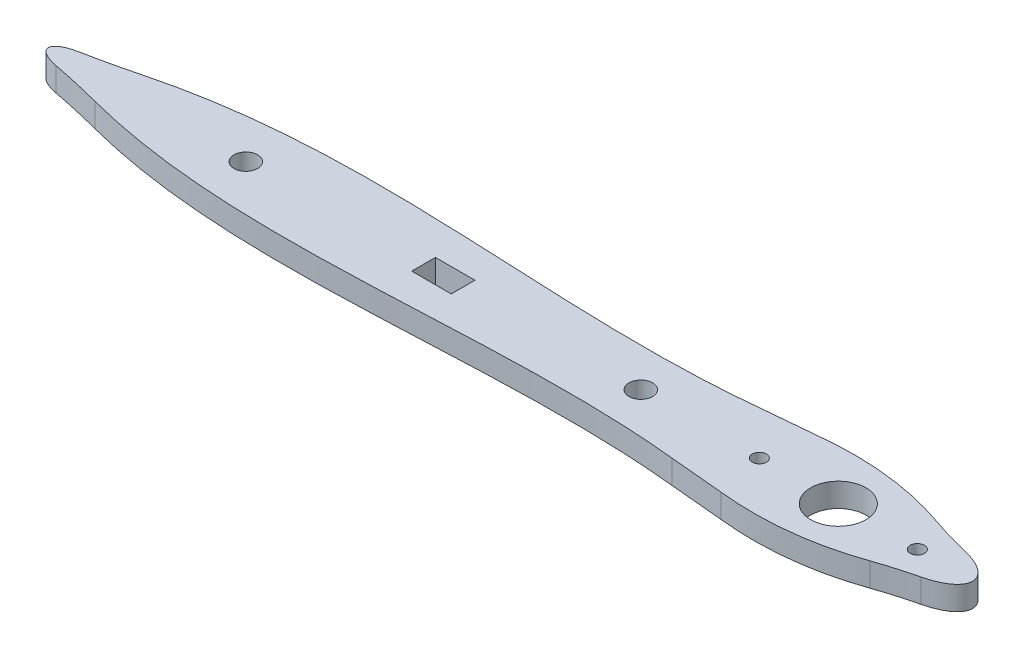
ISO-10303-21;
HEADER;
FILE_DESCRIPTION(('STEP AP214'),'2;1');
FILE_NAME('part.step','',(''),(''),'','','');
FILE_SCHEMA(('AUTOMOTIVE_DESIGN { 1 0 10303 214 1 1 1 1 }'));
ENDSEC;
DATA;
#1=APPLICATION_CONTEXT('core data for automotive mechanical design processes');
#2=APPLICATION_PROTOCOL_DEFINITION('international standard','automotive_design',2000,#1);
#3=PRODUCT_CONTEXT('',#1,'mechanical');
#4=PRODUCT('Part','Part','',(#3));
#5=PRODUCT_RELATED_PRODUCT_CATEGORY('part','',(#4));
#6=PRODUCT_DEFINITION_FORMATION('','',#4);
#7=PRODUCT_DEFINITION_CONTEXT('part definition',#1,'design');
#8=PRODUCT_DEFINITION('design','',#6,#7);
#9=PRODUCT_DEFINITION_SHAPE('','',#8);
#10=(LENGTH_UNIT() NAMED_UNIT(*) SI_UNIT(.MILLI.,.METRE.));
#11=(NAMED_UNIT(*) PLANE_ANGLE_UNIT() SI_UNIT($,.RADIAN.));
#12=(NAMED_UNIT(*) SI_UNIT($,.STERADIAN.) SOLID_ANGLE_UNIT());
#13=UNCERTAINTY_MEASURE_WITH_UNIT(LENGTH_MEASURE(1.E-05),#10,'distance_accuracy_value','');
#14=(GEOMETRIC_REPRESENTATION_CONTEXT(3) GLOBAL_UNCERTAINTY_ASSIGNED_CONTEXT((#13)) GLOBAL_UNIT_ASSIGNED_CONTEXT((#10,
#11,#12)) REPRESENTATION_CONTEXT('',''));
#15=CARTESIAN_POINT('',(0.,0.,0.));
#16=DIRECTION('',(0.,0.,1.));
#17=DIRECTION('',(1.,0.,0.));
#18=AXIS2_PLACEMENT_3D('',#15,#16,#17);
#19=CARTESIAN_POINT('',(-47.5,3.,0.));
#20=DIRECTION('',(-1.,0.,0.));
#21=DIRECTION('',(0.,0.,1.));
#22=AXIS2_PLACEMENT_3D('',#19,#20,#21);
#23=PLANE('',#22);
#24=DIRECTION('',(0.,0.,-1.));
#25=VECTOR('',#24,1.);
#26=CARTESIAN_POINT('',(-47.5,0.,0.));
#27=LINE('',#26,#25);
#28=CARTESIAN_POINT('',(-47.5,0.,1.50000000000001));
#29=VERTEX_POINT('',#28);
#30=CARTESIAN_POINT('',(-47.5,0.,-1.50000000000008));
#31=VERTEX_POINT('',#30);
#32=EDGE_CURVE('E277',#29,#31,#27,.T.);
#33=ORIENTED_EDGE('',*,*,#32,.F.);
#34=DIRECTION('',(0.,-1.,0.));
#35=VECTOR('',#34,1.);
#36=CARTESIAN_POINT('',(-47.5,3.,1.50000000000001));
#37=LINE('',#36,#35);
#38=CARTESIAN_POINT('',(-47.5,3.,1.50000000000001));
#39=VERTEX_POINT('',#38);
#40=EDGE_CURVE('E11',#39,#29,#37,.T.);
#41=ORIENTED_EDGE('',*,*,#40,.F.);
#42=DIRECTION('',(0.,0.,-1.));
#43=VECTOR('',#42,1.);
#44=CARTESIAN_POINT('',(-47.5,3.,0.));
#45=LINE('',#44,#43);
#46=CARTESIAN_POINT('',(-47.5,3.,-1.50000000000008));
#47=VERTEX_POINT('',#46);
#48=EDGE_CURVE('E181',#39,#47,#45,.T.);
#49=ORIENTED_EDGE('',*,*,#48,.T.);
#50=DIRECTION('',(0.,-1.,0.));
#51=VECTOR('',#50,1.);
#52=CARTESIAN_POINT('',(-47.5,3.,-1.50000000000008));
#53=LINE('',#52,#51);
#54=EDGE_CURVE('E62',#47,#31,#53,.T.);
#55=ORIENTED_EDGE('',*,*,#54,.T.);
#56=EDGE_LOOP('',(#33,#41,#49,#55));
#57=FACE_BOUND('',#56,.T.);
#58=ADVANCED_FACE('F41',(#57),#23,.T.);
#59=CARTESIAN_POINT('',(0.,3.,1.50000000000001));
#60=DIRECTION('',(0.,0.,-1.));
#61=DIRECTION('',(-1.,0.,0.));
#62=AXIS2_PLACEMENT_3D('',#59,#60,#61);
#63=PLANE('',#62);
#64=DIRECTION('',(1.,0.,0.));
#65=VECTOR('',#64,1.);
#66=CARTESIAN_POINT('',(0.,0.,1.50000000000001));
#67=LINE('',#66,#65);
#68=CARTESIAN_POINT('',(-52.5,0.,1.50000000000001));
#69=VERTEX_POINT('',#68);
#70=EDGE_CURVE('E168',#69,#29,#67,.T.);
#71=ORIENTED_EDGE('',*,*,#70,.F.);
#72=DIRECTION('',(0.,-1.,0.));
#73=VECTOR('',#72,1.);
#74=CARTESIAN_POINT('',(-52.5,3.,1.50000000000001));
#75=LINE('',#74,#73);
#76=CARTESIAN_POINT('',(-52.5,3.,1.50000000000001));
#77=VERTEX_POINT('',#76);
#78=EDGE_CURVE('E53',#77,#69,#75,.T.);
#79=ORIENTED_EDGE('',*,*,#78,.F.);
#80=DIRECTION('',(1.,0.,0.));
#81=VECTOR('',#80,1.);
#82=CARTESIAN_POINT('',(0.,3.,1.50000000000001));
#83=LINE('',#82,#81);
#84=EDGE_CURVE('E166',#77,#39,#83,.T.);
#85=ORIENTED_EDGE('',*,*,#84,.T.);
#86=ORIENTED_EDGE('',*,*,#40,.T.);
#87=EDGE_LOOP('',(#71,#79,#85,#86));
#88=FACE_BOUND('',#87,.T.);
#89=ADVANCED_FACE('F165',(#88),#63,.T.);
#90=CARTESIAN_POINT('',(-52.5,3.,0.));
#91=DIRECTION('',(1.,0.,0.));
#92=DIRECTION('',(0.,0.,-1.));
#93=AXIS2_PLACEMENT_3D('',#90,#91,#92);
#94=PLANE('',#93);
#95=DIRECTION('',(0.,0.,1.));
#96=VECTOR('',#95,1.);
#97=CARTESIAN_POINT('',(-52.5,0.,0.));
#98=LINE('',#97,#96);
#99=CARTESIAN_POINT('',(-52.5,0.,-1.50000000000008));
#100=VERTEX_POINT('',#99);
#101=EDGE_CURVE('E282',#100,#69,#98,.T.);
#102=ORIENTED_EDGE('',*,*,#101,.F.);
#103=DIRECTION('',(0.,-1.,0.));
#104=VECTOR('',#103,1.);
#105=CARTESIAN_POINT('',(-52.5,3.,-1.50000000000008));
#106=LINE('',#105,#104);
#107=CARTESIAN_POINT('',(-52.5,3.,-1.50000000000008));
#108=VERTEX_POINT('',#107);
#109=EDGE_CURVE('E111',#108,#100,#106,.T.);
#110=ORIENTED_EDGE('',*,*,#109,.F.);
#111=DIRECTION('',(0.,0.,1.));
#112=VECTOR('',#111,1.);
#113=CARTESIAN_POINT('',(-52.5,3.,0.));
#114=LINE('',#113,#112);
#115=EDGE_CURVE('E180',#108,#77,#114,.T.);
#116=ORIENTED_EDGE('',*,*,#115,.T.);
#117=ORIENTED_EDGE('',*,*,#78,.T.);
#118=EDGE_LOOP('',(#102,#110,#116,#117));
#119=FACE_BOUND('',#118,.T.);
#120=ADVANCED_FACE('F184',(#119),#94,.T.);
#121=CARTESIAN_POINT('',(-95.4266181455895,3.,0.));
#122=DIRECTION('',(0.,1.,0.));
#123=DIRECTION('',(-1.,0.,0.));
#124=AXIS2_PLACEMENT_3D('',#121,#122,#123);
#125=ELLIPSE('',#124,4.5733818544105,1.67774940956735);
#126=DIRECTION('',(0.,-1.,0.));
#127=VECTOR('',#126,1.);
#128=SURFACE_OF_LINEAR_EXTRUSION('',#125,#127);
#129=CARTESIAN_POINT('',(-95.4266181455895,0.,0.));
#130=DIRECTION('',(0.,1.,0.));
#131=DIRECTION('',(-1.,0.,0.));
#132=AXIS2_PLACEMENT_3D('',#129,#130,#131);
#133=ELLIPSE('',#132,4.5733818544105,1.67774940956735);
#134=CARTESIAN_POINT('',(-97.5494712931568,0.,-1.48605495763457));
#135=VERTEX_POINT('',#134);
#136=CARTESIAN_POINT('',(-97.5494712931573,0.,1.4860549576345));
#137=VERTEX_POINT('',#136);
#138=EDGE_CURVE('E209',#135,#137,#133,.T.);
#139=ORIENTED_EDGE('',*,*,#138,.T.);
#140=DIRECTION('',(0.,-1.,0.));
#141=VECTOR('',#140,1.);
#142=CARTESIAN_POINT('',(-97.5494712931573,3.,1.4860549576345));
#143=LINE('',#142,#141);
#144=CARTESIAN_POINT('',(-97.5494712931573,3.,1.4860549576345));
#145=VERTEX_POINT('',#144);
#146=EDGE_CURVE('E46',#145,#137,#143,.T.);
#147=ORIENTED_EDGE('',*,*,#146,.F.);
#148=CARTESIAN_POINT('',(-97.5494712931568,3.,-1.48605495763457));
#149=VERTEX_POINT('',#148);
#150=EDGE_CURVE('E305',#149,#145,#125,.T.);
#151=ORIENTED_EDGE('',*,*,#150,.F.);
#152=DIRECTION('',(0.,-1.,0.));
#153=VECTOR('',#152,1.);
#154=CARTESIAN_POINT('',(-97.5494712931568,3.,-1.48605495763457));
#155=LINE('',#154,#153);
#156=EDGE_CURVE('E208',#149,#135,#155,.T.);
#157=ORIENTED_EDGE('',*,*,#156,.T.);
#158=EDGE_LOOP('',(#139,#147,#151,#157));
#159=FACE_BOUND('',#158,.T.);
#160=ADVANCED_FACE('F43',(#159),#128,.F.);
#161=CARTESIAN_POINT('',(-116.428663075595,3.,99.6877663360108));
#162=DIRECTION('',(0.,-1.,0.));
#163=DIRECTION('',(0.,0.,-1.));
#164=AXIS2_PLACEMENT_3D('',#161,#162,#163);
#165=CYLINDRICAL_SURFACE('',#164,100.);
#166=CARTESIAN_POINT('',(-116.428663075595,0.,99.6877663360108));
#167=DIRECTION('',(0.,1.,0.));
#168=DIRECTION('',(0.,0.,1.));
#169=AXIS2_PLACEMENT_3D('',#166,#167,#168);
#170=CIRCLE('',#169,100.);
#171=CARTESIAN_POINT('',(-91.1354786617065,0.,2.9393564152012));
#172=VERTEX_POINT('',#171);
#173=EDGE_CURVE('E213',#137,#172,#170,.F.);
#174=ORIENTED_EDGE('',*,*,#173,.T.);
#175=DIRECTION('',(0.,-1.,0.));
#176=VECTOR('',#175,1.);
#177=CARTESIAN_POINT('',(-91.1354786617065,3.,2.9393564152012));
#178=LINE('',#177,#176);
#179=CARTESIAN_POINT('',(-91.1354786617065,3.,2.9393564152012));
#180=VERTEX_POINT('',#179);
#181=EDGE_CURVE('E341',#180,#172,#178,.T.);
#182=ORIENTED_EDGE('',*,*,#181,.F.);
#183=CARTESIAN_POINT('',(-116.428663075595,3.,99.6877663360108));
#184=DIRECTION('',(0.,1.,0.));
#185=DIRECTION('',(0.,0.,1.));
#186=AXIS2_PLACEMENT_3D('',#183,#184,#185);
#187=CIRCLE('',#186,100.);
#188=EDGE_CURVE('E124',#145,#180,#187,.F.);
#189=ORIENTED_EDGE('',*,*,#188,.F.);
#190=ORIENTED_EDGE('',*,*,#146,.T.);
#191=EDGE_LOOP('',(#174,#182,#189,#190));
#192=FACE_BOUND('',#191,.T.);
#193=ADVANCED_FACE('F349',(#192),#165,.F.);
#194=CARTESIAN_POINT('',(-91.1354786617065,3.,2.93935641520122));
#195=CARTESIAN_POINT('',(-85.8147090714319,3.,4.33037882663711));
#196=CARTESIAN_POINT('',(-60.9175612268035,3.,7.97508815959745));
#197=CARTESIAN_POINT('',(-35.1324327132966,3.,3.48955228013661));
#198=CARTESIAN_POINT('',(-15.53242609968,3.,5.5269007593906));
#199=B_SPLINE_CURVE_WITH_KNOTS('',3,(#194,#195,#196,#197,#198),.UNSPECIFIED.,.F.,.F.,(4,1,4),
(0.107974897642226,0.300967180896954,1.),.UNSPECIFIED.);
#200=DIRECTION('',(0.,-1.,0.));
#201=VECTOR('',#200,1.);
#202=SURFACE_OF_LINEAR_EXTRUSION('',#199,#201);
#203=CARTESIAN_POINT('',(-91.1354786617065,0.,2.93935641520122));
#204=CARTESIAN_POINT('',(-85.8147090714319,0.,4.33037882663711));
#205=CARTESIAN_POINT('',(-60.9175612268035,0.,7.97508815959745));
#206=CARTESIAN_POINT('',(-35.1324327132966,0.,3.48955228013661));
#207=CARTESIAN_POINT('',(-15.53242609968,0.,5.5269007593906));
#208=B_SPLINE_CURVE_WITH_KNOTS('',3,(#203,#204,#205,#206,#207),.UNSPECIFIED.,.F.,.F.,(4,1,4),
(0.107974897642226,0.300967180896954,1.),.UNSPECIFIED.);
#209=CARTESIAN_POINT('',(-15.53242609968,0.,5.5269007593906));
#210=VERTEX_POINT('',#209);
#211=EDGE_CURVE('E216',#172,#210,#208,.T.);
#212=ORIENTED_EDGE('',*,*,#211,.T.);
#213=DIRECTION('',(0.,-1.,0.));
#214=VECTOR('',#213,1.);
#215=CARTESIAN_POINT('',(-15.53242609968,3.,5.5269007593906));
#216=LINE('',#215,#214);
#217=CARTESIAN_POINT('',(-15.53242609968,3.,5.5269007593906));
#218=VERTEX_POINT('',#217);
#219=EDGE_CURVE('E339',#218,#210,#216,.T.);
#220=ORIENTED_EDGE('',*,*,#219,.F.);
#221=EDGE_CURVE('E627',#180,#218,#199,.T.);
#222=ORIENTED_EDGE('',*,*,#221,.F.);
#223=ORIENTED_EDGE('',*,*,#181,.T.);
#224=EDGE_LOOP('',(#212,#220,#222,#223));
#225=FACE_BOUND('',#224,.T.);
#226=ADVANCED_FACE('F410',(#225),#202,.F.);
#227=CARTESIAN_POINT('',(-0.628159630564506,3.,6.88642461198352));
#228=DIRECTION('',(-0.0908399557754633,0.,0.995865504189553));
#229=DIRECTION('',(0.995865504189553,0.,0.0908399557754633));
#230=AXIS2_PLACEMENT_3D('',#227,#228,#229);
#231=PLANE('',#230);
#232=DIRECTION('',(-0.995865504189553,0.,-0.0908399557754633));
#233=VECTOR('',#232,1.);
#234=CARTESIAN_POINT('',(-0.628159630564506,0.,6.88642461198352));
#235=LINE('',#234,#233);
#236=CARTESIAN_POINT('',(-8.7014778224339,0.,6.14999999999991));
#237=VERTEX_POINT('',#236);
#238=EDGE_CURVE('E222',#237,#210,#235,.T.);
#239=ORIENTED_EDGE('',*,*,#238,.F.);
#240=DIRECTION('',(0.,-1.,0.));
#241=VECTOR('',#240,1.);
#242=CARTESIAN_POINT('',(-8.7014778224339,3.,6.14999999999991));
#243=LINE('',#242,#241);
#244=CARTESIAN_POINT('',(-8.7014778224339,3.,6.14999999999991));
#245=VERTEX_POINT('',#244);
#246=EDGE_CURVE('E336',#245,#237,#243,.T.);
#247=ORIENTED_EDGE('',*,*,#246,.F.);
#248=DIRECTION('',(-0.995865504189553,0.,-0.0908399557754633));
#249=VECTOR('',#248,1.);
#250=CARTESIAN_POINT('',(-0.628159630564506,3.,6.88642461198352));
#251=LINE('',#250,#249);
#252=EDGE_CURVE('E409',#245,#218,#251,.T.);
#253=ORIENTED_EDGE('',*,*,#252,.T.);
#254=ORIENTED_EDGE('',*,*,#219,.T.);
#255=EDGE_LOOP('',(#239,#247,#253,#254));
#256=FACE_BOUND('',#255,.T.);
#257=ADVANCED_FACE('F405',(#256),#231,.T.);
#258=CARTESIAN_POINT('',(8.2697237420884,3.,4.25946897668879));
#259=CARTESIAN_POINT('',(2.8349132427452,3.,6.15734876027866));
#260=CARTESIAN_POINT('',(-2.82215392505476,3.,6.78752581668376));
#261=CARTESIAN_POINT('',(-8.7014778224339,3.,6.14999999999991));
#262=B_SPLINE_CURVE_WITH_KNOTS('',3,(#258,#259,#260,#261),.UNSPECIFIED.,.F.,.F.,(4,4),
(0.353889440275628,1.),.UNSPECIFIED.);
#263=DIRECTION('',(0.,-1.,0.));
#264=VECTOR('',#263,1.);
#265=SURFACE_OF_LINEAR_EXTRUSION('',#262,#264);
#266=CARTESIAN_POINT('',(8.2697237420884,0.,4.25946897668879));
#267=CARTESIAN_POINT('',(2.8349132427452,0.,6.15734876027866));
#268=CARTESIAN_POINT('',(-2.82215392505476,0.,6.78752581668376));
#269=CARTESIAN_POINT('',(-8.7014778224339,0.,6.14999999999991));
#270=B_SPLINE_CURVE_WITH_KNOTS('',3,(#266,#267,#268,#269),.UNSPECIFIED.,.F.,.F.,(4,4),
(0.353889440275628,1.),.UNSPECIFIED.);
#271=CARTESIAN_POINT('',(8.2697237420884,0.,4.25946897668879));
#272=VERTEX_POINT('',#271);
#273=EDGE_CURVE('E229',#272,#237,#270,.T.);
#274=ORIENTED_EDGE('',*,*,#273,.F.);
#275=DIRECTION('',(0.,-1.,0.));
#276=VECTOR('',#275,1.);
#277=CARTESIAN_POINT('',(8.2697237420884,3.,4.25946897668879));
#278=LINE('',#277,#276);
#279=CARTESIAN_POINT('',(8.2697237420884,3.,4.25946897668879));
#280=VERTEX_POINT('',#279);
#281=EDGE_CURVE('E333',#280,#272,#278,.T.);
#282=ORIENTED_EDGE('',*,*,#281,.F.);
#283=EDGE_CURVE('E402',#280,#245,#262,.T.);
#284=ORIENTED_EDGE('',*,*,#283,.T.);
#285=ORIENTED_EDGE('',*,*,#246,.T.);
#286=EDGE_LOOP('',(#274,#282,#284,#285));
#287=FACE_BOUND('',#286,.T.);
#288=ADVANCED_FACE('F401',(#287),#265,.T.);
#289=CARTESIAN_POINT('',(24.753938545321,3.,51.4640308570935));
#290=DIRECTION('',(0.,-1.,0.));
#291=DIRECTION('',(0.,0.,-1.));
#292=AXIS2_PLACEMENT_3D('',#289,#290,#291);
#293=CYLINDRICAL_SURFACE('',#292,50.0000000000007);
#294=CARTESIAN_POINT('',(24.753938545321,0.,51.4640308570935));
#295=DIRECTION('',(0.,1.,0.));
#296=DIRECTION('',(0.,0.,1.));
#297=AXIS2_PLACEMENT_3D('',#294,#295,#296);
#298=CIRCLE('',#297,50.0000000000007);
#299=CARTESIAN_POINT('',(13.2431532591674,0.,2.80704963038625));
#300=VERTEX_POINT('',#299);
#301=EDGE_CURVE('E235',#272,#300,#298,.F.);
#302=ORIENTED_EDGE('',*,*,#301,.T.);
#303=DIRECTION('',(0.,-1.,0.));
#304=VECTOR('',#303,1.);
#305=CARTESIAN_POINT('',(13.2431532591674,3.,2.80704963038625));
#306=LINE('',#305,#304);
#307=CARTESIAN_POINT('',(13.2431532591674,3.,2.80704963038625));
#308=VERTEX_POINT('',#307);
#309=EDGE_CURVE('E329',#308,#300,#306,.T.);
#310=ORIENTED_EDGE('',*,*,#309,.F.);
#311=CARTESIAN_POINT('',(24.753938545321,3.,51.4640308570935));
#312=DIRECTION('',(0.,1.,0.));
#313=DIRECTION('',(0.,0.,1.));
#314=AXIS2_PLACEMENT_3D('',#311,#312,#313);
#315=CIRCLE('',#314,50.0000000000007);
#316=EDGE_CURVE('E397',#280,#308,#315,.F.);
#317=ORIENTED_EDGE('',*,*,#316,.F.);
#318=ORIENTED_EDGE('',*,*,#281,.T.);
#319=EDGE_LOOP('',(#302,#310,#317,#318));
#320=FACE_BOUND('',#319,.T.);
#321=ADVANCED_FACE('F396',(#320),#293,.F.);
#322=CARTESIAN_POINT('',(10.0000045781328,3.,-7.43034571371037E-07));
#323=DIRECTION('',(0.,1.,0.));
#324=DIRECTION('',(1.,0.,0.));
#325=AXIS2_PLACEMENT_3D('',#322,#323,#324);
#326=ELLIPSE('',#325,6.99999866487509,3.16752117407591);
#327=DIRECTION('',(0.,-1.,0.));
#328=VECTOR('',#327,1.);
#329=SURFACE_OF_LINEAR_EXTRUSION('',#326,#328);
#330=CARTESIAN_POINT('',(10.0000045781328,0.,-7.43034571371037E-07));
#331=DIRECTION('',(0.,1.,0.));
#332=DIRECTION('',(1.,0.,0.));
#333=AXIS2_PLACEMENT_3D('',#330,#331,#332);
#334=ELLIPSE('',#333,6.99999866487509,3.16752117407591);
#335=CARTESIAN_POINT('',(13.2431507603538,0.,-2.80705170759964));
#336=VERTEX_POINT('',#335);
#337=EDGE_CURVE('E241',#300,#336,#334,.T.);
#338=ORIENTED_EDGE('',*,*,#337,.T.);
#339=DIRECTION('',(0.,-1.,0.));
#340=VECTOR('',#339,1.);
#341=CARTESIAN_POINT('',(13.2431507603538,3.,-2.80705170759964));
#342=LINE('',#341,#340);
#343=CARTESIAN_POINT('',(13.2431507603538,3.,-2.80705170759964));
#344=VERTEX_POINT('',#343);
#345=EDGE_CURVE('E325',#344,#336,#342,.T.);
#346=ORIENTED_EDGE('',*,*,#345,.F.);
#347=EDGE_CURVE('E393',#308,#344,#326,.T.);
#348=ORIENTED_EDGE('',*,*,#347,.F.);
#349=ORIENTED_EDGE('',*,*,#309,.T.);
#350=EDGE_LOOP('',(#338,#346,#348,#349));
#351=FACE_BOUND('',#350,.T.);
#352=ADVANCED_FACE('F390',(#351),#329,.F.);
#353=CARTESIAN_POINT('',(24.7539253519989,3.,-51.4640354643056));
#354=DIRECTION('',(0.,-1.,0.));
#355=DIRECTION('',(0.,0.,-1.));
#356=AXIS2_PLACEMENT_3D('',#353,#354,#355);
#357=CYLINDRICAL_SURFACE('',#356,50.0000000000001);
#358=CARTESIAN_POINT('',(24.7539253519989,0.,-51.4640354643056));
#359=DIRECTION('',(0.,1.,0.));
#360=DIRECTION('',(0.,0.,1.));
#361=AXIS2_PLACEMENT_3D('',#358,#359,#360);
#362=CIRCLE('',#361,50.0000000000001);
#363=CARTESIAN_POINT('',(8.26972374208836,0.,-4.25946897668882));
#364=VERTEX_POINT('',#363);
#365=EDGE_CURVE('E244',#336,#364,#362,.F.);
#366=ORIENTED_EDGE('',*,*,#365,.T.);
#367=DIRECTION('',(0.,-1.,0.));
#368=VECTOR('',#367,1.);
#369=CARTESIAN_POINT('',(8.26972374208836,3.,-4.25946897668882));
#370=LINE('',#369,#368);
#371=CARTESIAN_POINT('',(8.26972374208836,3.,-4.25946897668882));
#372=VERTEX_POINT('',#371);
#373=EDGE_CURVE('E321',#372,#364,#370,.T.);
#374=ORIENTED_EDGE('',*,*,#373,.F.);
#375=CARTESIAN_POINT('',(24.7539253519989,3.,-51.4640354643056));
#376=DIRECTION('',(0.,1.,0.));
#377=DIRECTION('',(0.,0.,1.));
#378=AXIS2_PLACEMENT_3D('',#375,#376,#377);
#379=CIRCLE('',#378,50.0000000000001);
#380=EDGE_CURVE('E384',#344,#372,#379,.F.);
#381=ORIENTED_EDGE('',*,*,#380,.F.);
#382=ORIENTED_EDGE('',*,*,#345,.T.);
#383=EDGE_LOOP('',(#366,#374,#381,#382));
#384=FACE_BOUND('',#383,.T.);
#385=ADVANCED_FACE('F383',(#384),#357,.F.);
#386=CARTESIAN_POINT('',(8.26972374208834,3.,-4.25946897668882));
#387=CARTESIAN_POINT('',(2.83491271348361,3.,-6.15734724087725));
#388=CARTESIAN_POINT('',(-2.82215338962121,3.,-6.7875273538036));
#389=CARTESIAN_POINT('',(-8.7014778224339,3.,-6.14999999999991));
#390=B_SPLINE_CURVE_WITH_KNOTS('',3,(#386,#387,#388,#389),.UNSPECIFIED.,.F.,.F.,(4,4),
(0.353889440275629,1.),.UNSPECIFIED.);
#391=DIRECTION('',(0.,-1.,0.));
#392=VECTOR('',#391,1.);
#393=SURFACE_OF_LINEAR_EXTRUSION('',#390,#392);
#394=CARTESIAN_POINT('',(8.26972374208834,0.,-4.25946897668882));
#395=CARTESIAN_POINT('',(2.83491271348361,0.,-6.15734724087725));
#396=CARTESIAN_POINT('',(-2.82215338962121,0.,-6.7875273538036));
#397=CARTESIAN_POINT('',(-8.7014778224339,0.,-6.14999999999991));
#398=B_SPLINE_CURVE_WITH_KNOTS('',3,(#394,#395,#396,#397),.UNSPECIFIED.,.F.,.F.,(4,4),
(0.353889440275629,1.),.UNSPECIFIED.);
#399=CARTESIAN_POINT('',(-8.7014778224339,0.,-6.1499999999999));
#400=VERTEX_POINT('',#399);
#401=EDGE_CURVE('E247',#364,#400,#398,.T.);
#402=ORIENTED_EDGE('',*,*,#401,.T.);
#403=DIRECTION('',(0.,-1.,0.));
#404=VECTOR('',#403,1.);
#405=CARTESIAN_POINT('',(-8.7014778224339,3.,-6.1499999999999));
#406=LINE('',#405,#404);
#407=CARTESIAN_POINT('',(-8.7014778224339,3.,-6.1499999999999));
#408=VERTEX_POINT('',#407);
#409=EDGE_CURVE('E318',#408,#400,#406,.T.);
#410=ORIENTED_EDGE('',*,*,#409,.F.);
#411=EDGE_CURVE('E380',#372,#408,#390,.T.);
#412=ORIENTED_EDGE('',*,*,#411,.F.);
#413=ORIENTED_EDGE('',*,*,#373,.T.);
#414=EDGE_LOOP('',(#402,#410,#412,#413));
#415=FACE_BOUND('',#414,.T.);
#416=ADVANCED_FACE('F378',(#415),#393,.F.);
#417=CARTESIAN_POINT('',(-0.628159630564511,3.,-6.88642461198353));
#418=DIRECTION('',(-0.0908399557754639,0.,-0.995865504189553));
#419=DIRECTION('',(-0.995865504189553,0.,0.0908399557754639));
#420=AXIS2_PLACEMENT_3D('',#417,#418,#419);
#421=PLANE('',#420);
#422=DIRECTION('',(0.995865504189553,0.,-0.0908399557754639));
#423=VECTOR('',#422,1.);
#424=CARTESIAN_POINT('',(-0.628159630564511,0.,-6.88642461198353));
#425=LINE('',#424,#423);
#426=CARTESIAN_POINT('',(-15.53242609968,0.,-5.52690075939059));
#427=VERTEX_POINT('',#426);
#428=EDGE_CURVE('E253',#427,#400,#425,.T.);
#429=ORIENTED_EDGE('',*,*,#428,.F.);
#430=DIRECTION('',(0.,-1.,0.));
#431=VECTOR('',#430,1.);
#432=CARTESIAN_POINT('',(-15.53242609968,3.,-5.52690075939059));
#433=LINE('',#432,#431);
#434=CARTESIAN_POINT('',(-15.53242609968,3.,-5.52690075939059));
#435=VERTEX_POINT('',#434);
#436=EDGE_CURVE('E315',#435,#427,#433,.T.);
#437=ORIENTED_EDGE('',*,*,#436,.F.);
#438=DIRECTION('',(0.995865504189553,0.,-0.0908399557754639));
#439=VECTOR('',#438,1.);
#440=CARTESIAN_POINT('',(-0.628159630564511,3.,-6.88642461198353));
#441=LINE('',#440,#439);
#442=EDGE_CURVE('E375',#435,#408,#441,.T.);
#443=ORIENTED_EDGE('',*,*,#442,.T.);
#444=ORIENTED_EDGE('',*,*,#409,.T.);
#445=EDGE_LOOP('',(#429,#437,#443,#444));
#446=FACE_BOUND('',#445,.T.);
#447=ADVANCED_FACE('F371',(#446),#421,.T.);
#448=CARTESIAN_POINT('',(-91.1354786617069,3.,-2.9393564152006));
#449=CARTESIAN_POINT('',(-85.8147090714331,3.,-4.33037882663589));
#450=CARTESIAN_POINT('',(-60.9175612267895,3.,-7.97508815960083));
#451=CARTESIAN_POINT('',(-35.1324327133063,3.,-3.48955228013343));
#452=CARTESIAN_POINT('',(-15.53242609968,3.,-5.52690075939059));
#453=B_SPLINE_CURVE_WITH_KNOTS('',3,(#448,#449,#450,#451,#452),.UNSPECIFIED.,.F.,.F.,(4,1,4),
(0.107974897642307,0.300967180896954,1.),.UNSPECIFIED.);
#454=DIRECTION('',(0.,-1.,0.));
#455=VECTOR('',#454,1.);
#456=SURFACE_OF_LINEAR_EXTRUSION('',#453,#455);
#457=CARTESIAN_POINT('',(-91.1354786617069,0.,-2.9393564152006));
#458=CARTESIAN_POINT('',(-85.8147090714331,0.,-4.33037882663589));
#459=CARTESIAN_POINT('',(-60.9175612267895,0.,-7.97508815960083));
#460=CARTESIAN_POINT('',(-35.1324327133063,0.,-3.48955228013343));
#461=CARTESIAN_POINT('',(-15.53242609968,0.,-5.52690075939059));
#462=B_SPLINE_CURVE_WITH_KNOTS('',3,(#457,#458,#459,#460,#461),.UNSPECIFIED.,.F.,.F.,(4,1,4),
(0.107974897642307,0.300967180896954,1.),.UNSPECIFIED.);
#463=CARTESIAN_POINT('',(-91.1354786617069,0.,-2.9393564152006));
#464=VERTEX_POINT('',#463);
#465=EDGE_CURVE('E260',#464,#427,#462,.T.);
#466=ORIENTED_EDGE('',*,*,#465,.F.);
#467=DIRECTION('',(0.,-1.,0.));
#468=VECTOR('',#467,1.);
#469=CARTESIAN_POINT('',(-91.1354786617069,3.,-2.9393564152006));
#470=LINE('',#469,#468);
#471=CARTESIAN_POINT('',(-91.1354786617069,3.,-2.9393564152006));
#472=VERTEX_POINT('',#471);
#473=EDGE_CURVE('E312',#472,#464,#470,.T.);
#474=ORIENTED_EDGE('',*,*,#473,.F.);
#475=EDGE_CURVE('E440',#472,#435,#453,.T.);
#476=ORIENTED_EDGE('',*,*,#475,.T.);
#477=ORIENTED_EDGE('',*,*,#436,.T.);
#478=EDGE_LOOP('',(#466,#474,#476,#477));
#479=FACE_BOUND('',#478,.T.);
#480=ADVANCED_FACE('F366',(#479),#456,.T.);
#481=CARTESIAN_POINT('',(0.,3.,0.));
#482=DIRECTION('',(0.,-1.,0.));
#483=DIRECTION('',(0.,0.,-1.));
#484=AXIS2_PLACEMENT_3D('',#481,#482,#483);
#485=CYLINDRICAL_SURFACE('',#484,3.50000000000001);
#486=CARTESIAN_POINT('',(0.,3.,0.));
#487=DIRECTION('',(0.,1.,0.));
#488=DIRECTION('',(0.,0.,1.));
#489=AXIS2_PLACEMENT_3D('',#486,#487,#488);
#490=CIRCLE('',#489,3.50000000000001);
#491=CARTESIAN_POINT('',(0.,3.,3.50000000000001));
#492=VERTEX_POINT('',#491);
#493=EDGE_CURVE('E200',#492,#492,#490,.T.);
#494=ORIENTED_EDGE('',*,*,#493,.T.);
#495=EDGE_LOOP('',(#494));
#496=FACE_BOUND('',#495,.T.);
#497=CARTESIAN_POINT('',(0.,0.,0.));
#498=DIRECTION('',(0.,1.,0.));
#499=DIRECTION('',(0.,0.,1.));
#500=AXIS2_PLACEMENT_3D('',#497,#498,#499);
#501=CIRCLE('',#500,3.50000000000001);
#502=CARTESIAN_POINT('',(0.,0.,3.50000000000001));
#503=VERTEX_POINT('',#502);
#504=EDGE_CURVE('E297',#503,#503,#501,.T.);
#505=ORIENTED_EDGE('',*,*,#504,.F.);
#506=EDGE_LOOP('',(#505));
#507=FACE_BOUND('',#506,.T.);
#508=ADVANCED_FACE('F438',(#496,#507),#485,.F.);
#509=CARTESIAN_POINT('',(-10.,3.,0.));
#510=DIRECTION('',(0.,-1.,0.));
#511=DIRECTION('',(0.,0.,-1.));
#512=AXIS2_PLACEMENT_3D('',#509,#510,#511);
#513=CYLINDRICAL_SURFACE('',#512,0.9);
#514=CARTESIAN_POINT('',(-10.,3.,0.));
#515=DIRECTION('',(0.,1.,0.));
#516=DIRECTION('',(0.,0.,1.));
#517=AXIS2_PLACEMENT_3D('',#514,#515,#516);
#518=CIRCLE('',#517,0.9);
#519=CARTESIAN_POINT('',(-10.,3.,0.900000000000001));
#520=VERTEX_POINT('',#519);
#521=EDGE_CURVE('E196',#520,#520,#518,.T.);
#522=ORIENTED_EDGE('',*,*,#521,.T.);
#523=EDGE_LOOP('',(#522));
#524=FACE_BOUND('',#523,.T.);
#525=CARTESIAN_POINT('',(-10.,0.,0.));
#526=DIRECTION('',(0.,1.,0.));
#527=DIRECTION('',(0.,0.,1.));
#528=AXIS2_PLACEMENT_3D('',#525,#526,#527);
#529=CIRCLE('',#528,0.9);
#530=CARTESIAN_POINT('',(-10.,0.,0.900000000000001));
#531=VERTEX_POINT('',#530);
#532=EDGE_CURVE('E293',#531,#531,#529,.T.);
#533=ORIENTED_EDGE('',*,*,#532,.F.);
#534=EDGE_LOOP('',(#533));
#535=FACE_BOUND('',#534,.T.);
#536=ADVANCED_FACE('F463',(#524,#535),#513,.F.);
#537=CARTESIAN_POINT('',(-25.,3.,0.));
#538=DIRECTION('',(0.,-1.,0.));
#539=DIRECTION('',(0.,0.,-1.));
#540=AXIS2_PLACEMENT_3D('',#537,#538,#539);
#541=CYLINDRICAL_SURFACE('',#540,1.50000000000002);
#542=CARTESIAN_POINT('',(-25.,3.,0.));
#543=DIRECTION('',(0.,1.,0.));
#544=DIRECTION('',(0.,0.,1.));
#545=AXIS2_PLACEMENT_3D('',#542,#543,#544);
#546=CIRCLE('',#545,1.50000000000002);
#547=CARTESIAN_POINT('',(-25.,3.,1.50000000000002));
#548=VERTEX_POINT('',#547);
#549=EDGE_CURVE('E189',#548,#548,#546,.T.);
#550=ORIENTED_EDGE('',*,*,#549,.T.);
#551=EDGE_LOOP('',(#550));
#552=FACE_BOUND('',#551,.T.);
#553=CARTESIAN_POINT('',(-25.,0.,0.));
#554=DIRECTION('',(0.,1.,0.));
#555=DIRECTION('',(0.,0.,1.));
#556=AXIS2_PLACEMENT_3D('',#553,#554,#555);
#557=CIRCLE('',#556,1.50000000000002);
#558=CARTESIAN_POINT('',(-25.,0.,1.50000000000002));
#559=VERTEX_POINT('',#558);
#560=EDGE_CURVE('E289',#559,#559,#557,.T.);
#561=ORIENTED_EDGE('',*,*,#560,.F.);
#562=EDGE_LOOP('',(#561));
#563=FACE_BOUND('',#562,.T.);
#564=ADVANCED_FACE('F458',(#552,#563),#541,.F.);
#565=CARTESIAN_POINT('',(0.,3.,-1.50000000000008));
#566=DIRECTION('',(0.,0.,1.));
#567=DIRECTION('',(1.,0.,0.));
#568=AXIS2_PLACEMENT_3D('',#565,#566,#567);
#569=PLANE('',#568);
#570=DIRECTION('',(-1.,0.,0.));
#571=VECTOR('',#570,1.);
#572=CARTESIAN_POINT('',(0.,0.,-1.50000000000008));
#573=LINE('',#572,#571);
#574=EDGE_CURVE('E285',#31,#100,#573,.T.);
#575=ORIENTED_EDGE('',*,*,#574,.F.);
#576=ORIENTED_EDGE('',*,*,#54,.F.);
#577=DIRECTION('',(-1.,0.,0.));
#578=VECTOR('',#577,1.);
#579=CARTESIAN_POINT('',(0.,3.,-1.50000000000008));
#580=LINE('',#579,#578);
#581=EDGE_CURVE('E186',#47,#108,#580,.T.);
#582=ORIENTED_EDGE('',*,*,#581,.T.);
#583=ORIENTED_EDGE('',*,*,#109,.T.);
#584=EDGE_LOOP('',(#575,#576,#582,#583));
#585=FACE_BOUND('',#584,.T.);
#586=ADVANCED_FACE('F430',(#585),#569,.T.);
#587=CARTESIAN_POINT('',(-75.,3.,0.));
#588=DIRECTION('',(0.,-1.,0.));
#589=DIRECTION('',(0.,0.,-1.));
#590=AXIS2_PLACEMENT_3D('',#587,#588,#589);
#591=CYLINDRICAL_SURFACE('',#590,1.49999999999989);
#592=CARTESIAN_POINT('',(-75.,3.,0.));
#593=DIRECTION('',(0.,1.,0.));
#594=DIRECTION('',(0.,0.,1.));
#595=AXIS2_PLACEMENT_3D('',#592,#593,#594);
#596=CIRCLE('',#595,1.49999999999989);
#597=CARTESIAN_POINT('',(-75.,3.,1.4999999999999));
#598=VERTEX_POINT('',#597);
#599=EDGE_CURVE('E453',#598,#598,#596,.T.);
#600=ORIENTED_EDGE('',*,*,#599,.T.);
#601=EDGE_LOOP('',(#600));
#602=FACE_BOUND('',#601,.T.);
#603=CARTESIAN_POINT('',(-75.,0.,0.));
#604=DIRECTION('',(0.,1.,0.));
#605=DIRECTION('',(0.,0.,1.));
#606=AXIS2_PLACEMENT_3D('',#603,#604,#605);
#607=CIRCLE('',#606,1.49999999999989);
#608=CARTESIAN_POINT('',(-75.,0.,1.4999999999999));
#609=VERTEX_POINT('',#608);
#610=EDGE_CURVE('E273',#609,#609,#607,.T.);
#611=ORIENTED_EDGE('',*,*,#610,.F.);
#612=EDGE_LOOP('',(#611));
#613=FACE_BOUND('',#612,.T.);
#614=ADVANCED_FACE('F427',(#602,#613),#591,.F.);
#615=CARTESIAN_POINT('',(-116.428663075589,3.,-99.6877663360121));
#616=DIRECTION('',(0.,-1.,0.));
#617=DIRECTION('',(0.,0.,-1.));
#618=AXIS2_PLACEMENT_3D('',#615,#616,#617);
#619=CYLINDRICAL_SURFACE('',#618,100.);
#620=CARTESIAN_POINT('',(-116.428663075589,0.,-99.6877663360121));
#621=DIRECTION('',(0.,1.,0.));
#622=DIRECTION('',(0.,0.,1.));
#623=AXIS2_PLACEMENT_3D('',#620,#621,#622);
#624=CIRCLE('',#623,100.);
#625=EDGE_CURVE('E266',#135,#464,#624,.T.);
#626=ORIENTED_EDGE('',*,*,#625,.F.);
#627=ORIENTED_EDGE('',*,*,#156,.F.);
#628=CARTESIAN_POINT('',(-116.428663075589,3.,-99.6877663360121));
#629=DIRECTION('',(0.,1.,0.));
#630=DIRECTION('',(0.,0.,1.));
#631=AXIS2_PLACEMENT_3D('',#628,#629,#630);
#632=CIRCLE('',#631,100.);
#633=EDGE_CURVE('E362',#149,#472,#632,.T.);
#634=ORIENTED_EDGE('',*,*,#633,.T.);
#635=ORIENTED_EDGE('',*,*,#473,.T.);
#636=EDGE_LOOP('',(#626,#627,#634,#635));
#637=FACE_BOUND('',#636,.T.);
#638=ADVANCED_FACE('F358',(#637),#619,.F.);
#639=CARTESIAN_POINT('',(10.,3.,0.));
#640=DIRECTION('',(0.,-1.,0.));
#641=DIRECTION('',(0.,0.,-1.));
#642=AXIS2_PLACEMENT_3D('',#639,#640,#641);
#643=CYLINDRICAL_SURFACE('',#642,0.9);
#644=CARTESIAN_POINT('',(10.,3.,0.));
#645=DIRECTION('',(0.,1.,0.));
#646=DIRECTION('',(0.,0.,1.));
#647=AXIS2_PLACEMENT_3D('',#644,#645,#646);
#648=CIRCLE('',#647,0.9);
#649=CARTESIAN_POINT('',(10.,3.,0.9));
#650=VERTEX_POINT('',#649);
#651=EDGE_CURVE('E204',#650,#650,#648,.T.);
#652=ORIENTED_EDGE('',*,*,#651,.T.);
#653=EDGE_LOOP('',(#652));
#654=FACE_BOUND('',#653,.T.);
#655=CARTESIAN_POINT('',(10.,0.,0.));
#656=DIRECTION('',(0.,1.,0.));
#657=DIRECTION('',(0.,0.,1.));
#658=AXIS2_PLACEMENT_3D('',#655,#656,#657);
#659=CIRCLE('',#658,0.9);
#660=CARTESIAN_POINT('',(10.,0.,0.9));
#661=VERTEX_POINT('',#660);
#662=EDGE_CURVE('E301',#661,#661,#659,.T.);
#663=ORIENTED_EDGE('',*,*,#662,.F.);
#664=EDGE_LOOP('',(#663));
#665=FACE_BOUND('',#664,.T.);
#666=ADVANCED_FACE('F434',(#654,#665),#643,.F.);
#667=CARTESIAN_POINT('',(0.,3.,0.));
#668=DIRECTION('',(0.,1.,0.));
#669=DIRECTION('',(0.,0.,1.));
#670=AXIS2_PLACEMENT_3D('',#667,#668,#669);
#671=PLANE('',#670);
#672=ORIENTED_EDGE('',*,*,#150,.T.);
#673=ORIENTED_EDGE('',*,*,#188,.T.);
#674=ORIENTED_EDGE('',*,*,#221,.T.);
#675=ORIENTED_EDGE('',*,*,#252,.F.);
#676=ORIENTED_EDGE('',*,*,#283,.F.);
#677=ORIENTED_EDGE('',*,*,#316,.T.);
#678=ORIENTED_EDGE('',*,*,#347,.T.);
#679=ORIENTED_EDGE('',*,*,#380,.T.);
#680=ORIENTED_EDGE('',*,*,#411,.T.);
#681=ORIENTED_EDGE('',*,*,#442,.F.);
#682=ORIENTED_EDGE('',*,*,#475,.F.);
#683=ORIENTED_EDGE('',*,*,#633,.F.);
#684=EDGE_LOOP('',(#672,#673,#674,#675,#676,#677,#678,#679,#680,#681,#682,#683));
#685=FACE_BOUND('',#684,.T.);
#686=ORIENTED_EDGE('',*,*,#599,.F.);
#687=EDGE_LOOP('',(#686));
#688=FACE_BOUND('',#687,.T.);
#689=ORIENTED_EDGE('',*,*,#48,.F.);
#690=ORIENTED_EDGE('',*,*,#84,.F.);
#691=ORIENTED_EDGE('',*,*,#115,.F.);
#692=ORIENTED_EDGE('',*,*,#581,.F.);
#693=EDGE_LOOP('',(#689,#690,#691,#692));
#694=FACE_BOUND('',#693,.T.);
#695=ORIENTED_EDGE('',*,*,#549,.F.);
#696=EDGE_LOOP('',(#695));
#697=FACE_BOUND('',#696,.T.);
#698=ORIENTED_EDGE('',*,*,#521,.F.);
#699=EDGE_LOOP('',(#698));
#700=FACE_BOUND('',#699,.T.);
#701=ORIENTED_EDGE('',*,*,#493,.F.);
#702=EDGE_LOOP('',(#701));
#703=FACE_BOUND('',#702,.T.);
#704=ORIENTED_EDGE('',*,*,#651,.F.);
#705=EDGE_LOOP('',(#704));
#706=FACE_BOUND('',#705,.T.);
#707=ADVANCED_FACE('F177',(#685,#688,#694,#697,#700,#703,#706),#671,.T.);
#708=CARTESIAN_POINT('',(0.,0.,0.));
#709=DIRECTION('',(0.,1.,0.));
#710=DIRECTION('',(0.,0.,1.));
#711=AXIS2_PLACEMENT_3D('',#708,#709,#710);
#712=PLANE('',#711);
#713=ORIENTED_EDGE('',*,*,#138,.F.);
#714=ORIENTED_EDGE('',*,*,#625,.T.);
#715=ORIENTED_EDGE('',*,*,#465,.T.);
#716=ORIENTED_EDGE('',*,*,#428,.T.);
#717=ORIENTED_EDGE('',*,*,#401,.F.);
#718=ORIENTED_EDGE('',*,*,#365,.F.);
#719=ORIENTED_EDGE('',*,*,#337,.F.);
#720=ORIENTED_EDGE('',*,*,#301,.F.);
#721=ORIENTED_EDGE('',*,*,#273,.T.);
#722=ORIENTED_EDGE('',*,*,#238,.T.);
#723=ORIENTED_EDGE('',*,*,#211,.F.);
#724=ORIENTED_EDGE('',*,*,#173,.F.);
#725=EDGE_LOOP('',(#713,#714,#715,#716,#717,#718,#719,#720,#721,#722,#723,#724));
#726=FACE_BOUND('',#725,.T.);
#727=ORIENTED_EDGE('',*,*,#610,.T.);
#728=EDGE_LOOP('',(#727));
#729=FACE_BOUND('',#728,.T.);
#730=ORIENTED_EDGE('',*,*,#32,.T.);
#731=ORIENTED_EDGE('',*,*,#574,.T.);
#732=ORIENTED_EDGE('',*,*,#101,.T.);
#733=ORIENTED_EDGE('',*,*,#70,.T.);
#734=EDGE_LOOP('',(#730,#731,#732,#733));
#735=FACE_BOUND('',#734,.T.);
#736=ORIENTED_EDGE('',*,*,#560,.T.);
#737=EDGE_LOOP('',(#736));
#738=FACE_BOUND('',#737,.T.);
#739=ORIENTED_EDGE('',*,*,#532,.T.);
#740=EDGE_LOOP('',(#739));
#741=FACE_BOUND('',#740,.T.);
#742=ORIENTED_EDGE('',*,*,#504,.T.);
#743=EDGE_LOOP('',(#742));
#744=FACE_BOUND('',#743,.T.);
#745=ORIENTED_EDGE('',*,*,#662,.T.);
#746=EDGE_LOOP('',(#745));
#747=FACE_BOUND('',#746,.T.);
#748=ADVANCED_FACE('F355',(#726,#729,#735,#738,#741,#744,#747),#712,.F.);
#749=CLOSED_SHELL('',(#58,#89,#120,#160,#193,#226,#257,#288,#321,#352,#385,#416,#447,#480,#508,
#536,#564,#586,#614,#638,#666,#707,#748));
#750=MANIFOLD_SOLID_BREP('B2',#749);
#751=ADVANCED_BREP_SHAPE_REPRESENTATION('',(#18,#750),#14);
#752=SHAPE_DEFINITION_REPRESENTATION(#9,#751);
ENDSEC;
END-ISO-10303-21;
